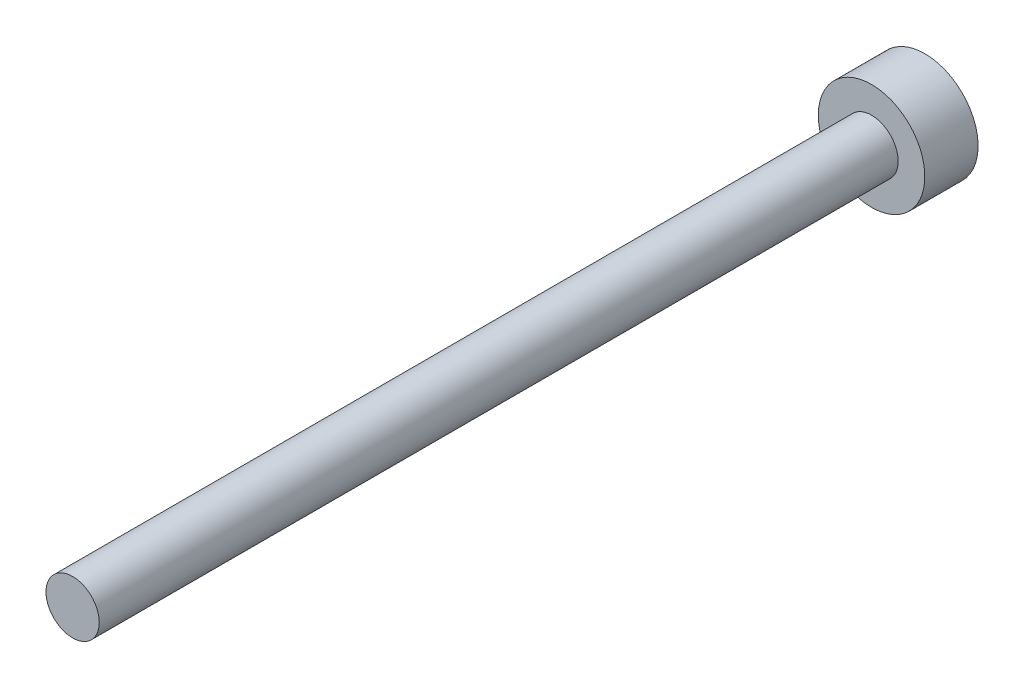
ISO-10303-21;
HEADER;
FILE_DESCRIPTION(('STEP AP214'),'2;1');
FILE_NAME('part.step','',(''),(''),'','','');
FILE_SCHEMA(('AUTOMOTIVE_DESIGN { 1 0 10303 214 1 1 1 1 }'));
ENDSEC;
DATA;
#1=APPLICATION_CONTEXT('core data for automotive mechanical design processes');
#2=APPLICATION_PROTOCOL_DEFINITION('international standard','automotive_design',2000,#1);
#3=PRODUCT_CONTEXT('',#1,'mechanical');
#4=PRODUCT('Part','Part','',(#3));
#5=PRODUCT_RELATED_PRODUCT_CATEGORY('part','',(#4));
#6=PRODUCT_DEFINITION_FORMATION('','',#4);
#7=PRODUCT_DEFINITION_CONTEXT('part definition',#1,'design');
#8=PRODUCT_DEFINITION('design','',#6,#7);
#9=PRODUCT_DEFINITION_SHAPE('','',#8);
#10=(LENGTH_UNIT() NAMED_UNIT(*) SI_UNIT(.MILLI.,.METRE.));
#11=(NAMED_UNIT(*) PLANE_ANGLE_UNIT() SI_UNIT($,.RADIAN.));
#12=(NAMED_UNIT(*) SI_UNIT($,.STERADIAN.) SOLID_ANGLE_UNIT());
#13=UNCERTAINTY_MEASURE_WITH_UNIT(LENGTH_MEASURE(1.E-05),#10,'distance_accuracy_value','');
#14=(GEOMETRIC_REPRESENTATION_CONTEXT(3) GLOBAL_UNCERTAINTY_ASSIGNED_CONTEXT((#13)) GLOBAL_UNIT_ASSIGNED_CONTEXT((#10,
#11,#12)) REPRESENTATION_CONTEXT('',''));
#15=CARTESIAN_POINT('',(0.,0.,0.));
#16=DIRECTION('',(0.,0.,1.));
#17=DIRECTION('',(1.,0.,0.));
#18=AXIS2_PLACEMENT_3D('',#15,#16,#17);
#19=CARTESIAN_POINT('',(0.,0.,45.));
#20=DIRECTION('',(0.,0.,-1.));
#21=DIRECTION('',(-1.,0.,0.));
#22=AXIS2_PLACEMENT_3D('',#19,#20,#21);
#23=CYLINDRICAL_SURFACE('',#22,1.5);
#24=CARTESIAN_POINT('',(0.,0.,45.));
#25=DIRECTION('',(0.,0.,1.));
#26=DIRECTION('',(1.,0.,0.));
#27=AXIS2_PLACEMENT_3D('',#24,#25,#26);
#28=CIRCLE('',#27,1.5);
#29=CARTESIAN_POINT('',(1.5,0.,45.));
#30=VERTEX_POINT('',#29);
#31=EDGE_CURVE('E10',#30,#30,#28,.T.);
#32=ORIENTED_EDGE('',*,*,#31,.F.);
#33=EDGE_LOOP('',(#32));
#34=FACE_BOUND('',#33,.T.);
#35=CARTESIAN_POINT('',(0.,0.,0.));
#36=DIRECTION('',(0.,0.,-1.));
#37=DIRECTION('',(-1.,0.,0.));
#38=AXIS2_PLACEMENT_3D('',#35,#36,#37);
#39=CIRCLE('',#38,1.5);
#40=CARTESIAN_POINT('',(-1.5,0.,0.));
#41=VERTEX_POINT('',#40);
#42=EDGE_CURVE('E40',#41,#41,#39,.T.);
#43=ORIENTED_EDGE('',*,*,#42,.F.);
#44=EDGE_LOOP('',(#43));
#45=FACE_BOUND('',#44,.T.);
#46=ADVANCED_FACE('F34',(#34,#45),#23,.T.);
#47=CARTESIAN_POINT('',(0.,0.,45.));
#48=DIRECTION('',(0.,0.,1.));
#49=DIRECTION('',(1.,0.,0.));
#50=AXIS2_PLACEMENT_3D('',#47,#48,#49);
#51=PLANE('',#50);
#52=ORIENTED_EDGE('',*,*,#31,.T.);
#53=EDGE_LOOP('',(#52));
#54=FACE_BOUND('',#53,.T.);
#55=ADVANCED_FACE('F67',(#54),#51,.T.);
#56=CARTESIAN_POINT('',(0.,0.,-3.));
#57=DIRECTION('',(0.,0.,1.));
#58=DIRECTION('',(1.,0.,0.));
#59=AXIS2_PLACEMENT_3D('',#56,#57,#58);
#60=CYLINDRICAL_SURFACE('',#59,3.);
#61=CARTESIAN_POINT('',(0.,0.,-3.));
#62=DIRECTION('',(0.,0.,-1.));
#63=DIRECTION('',(-1.,0.,0.));
#64=AXIS2_PLACEMENT_3D('',#61,#62,#63);
#65=CIRCLE('',#64,3.);
#66=CARTESIAN_POINT('',(-3.,0.,-3.));
#67=VERTEX_POINT('',#66);
#68=EDGE_CURVE('E44',#67,#67,#65,.T.);
#69=ORIENTED_EDGE('',*,*,#68,.F.);
#70=EDGE_LOOP('',(#69));
#71=FACE_BOUND('',#70,.T.);
#72=CARTESIAN_POINT('',(0.,0.,0.));
#73=DIRECTION('',(0.,0.,-1.));
#74=DIRECTION('',(-1.,0.,0.));
#75=AXIS2_PLACEMENT_3D('',#72,#73,#74);
#76=CIRCLE('',#75,3.);
#77=CARTESIAN_POINT('',(-3.,0.,0.));
#78=VERTEX_POINT('',#77);
#79=EDGE_CURVE('E48',#78,#78,#76,.T.);
#80=ORIENTED_EDGE('',*,*,#79,.T.);
#81=EDGE_LOOP('',(#80));
#82=FACE_BOUND('',#81,.T.);
#83=ADVANCED_FACE('F54',(#71,#82),#60,.T.);
#84=CARTESIAN_POINT('',(0.,0.,-3.));
#85=DIRECTION('',(0.,0.,-1.));
#86=DIRECTION('',(-1.,0.,0.));
#87=AXIS2_PLACEMENT_3D('',#84,#85,#86);
#88=PLANE('',#87);
#89=ORIENTED_EDGE('',*,*,#68,.T.);
#90=EDGE_LOOP('',(#89));
#91=FACE_BOUND('',#90,.T.);
#92=ADVANCED_FACE('F58',(#91),#88,.T.);
#93=CARTESIAN_POINT('',(0.,0.,0.));
#94=DIRECTION('',(0.,0.,-1.));
#95=DIRECTION('',(-1.,0.,0.));
#96=AXIS2_PLACEMENT_3D('',#93,#94,#95);
#97=PLANE('',#96);
#98=ORIENTED_EDGE('',*,*,#42,.T.);
#99=EDGE_LOOP('',(#98));
#100=FACE_BOUND('',#99,.T.);
#101=ORIENTED_EDGE('',*,*,#79,.F.);
#102=EDGE_LOOP('',(#101));
#103=FACE_BOUND('',#102,.T.);
#104=ADVANCED_FACE('F56',(#100,#103),#97,.F.);
#105=CLOSED_SHELL('',(#46,#55,#83,#92,#104));
#106=MANIFOLD_SOLID_BREP('B2',#105);
#107=ADVANCED_BREP_SHAPE_REPRESENTATION('',(#18,#106),#14);
#108=SHAPE_DEFINITION_REPRESENTATION(#9,#107);
ENDSEC;
END-ISO-10303-21;
